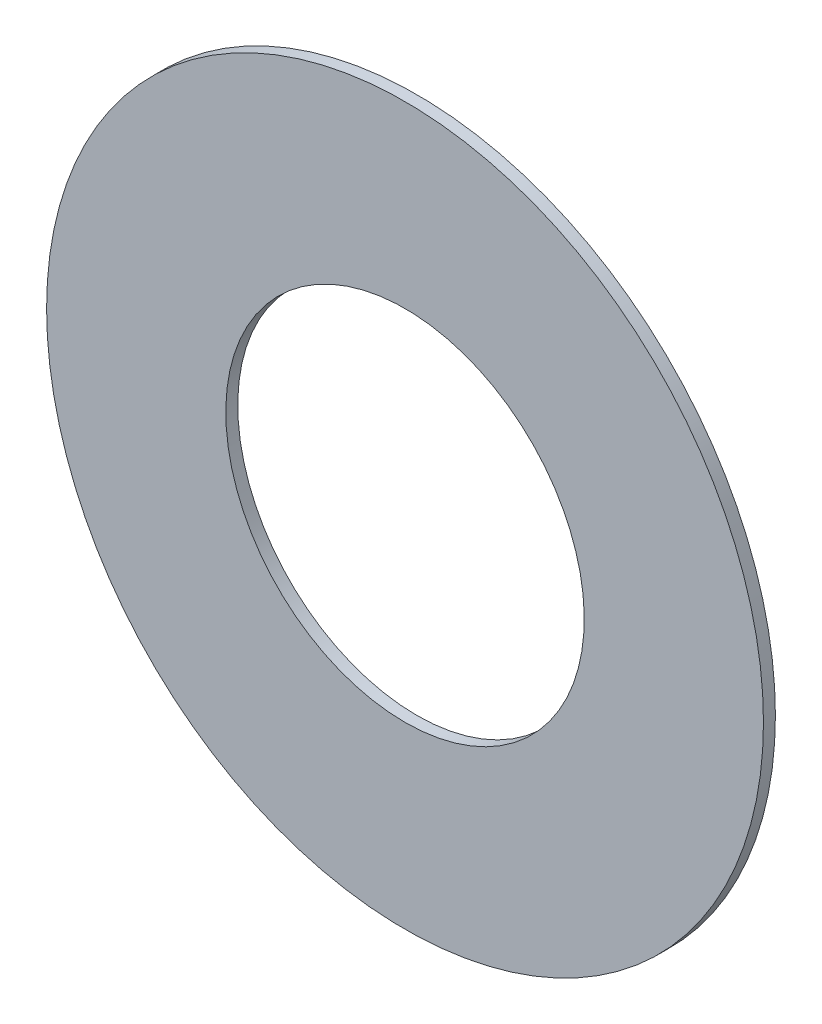
ISO-10303-21;
HEADER;
FILE_DESCRIPTION(('STEP AP214'),'2;1');
FILE_NAME('part.step','',(''),(''),'','','');
FILE_SCHEMA(('AUTOMOTIVE_DESIGN { 1 0 10303 214 1 1 1 1 }'));
ENDSEC;
DATA;
#1=APPLICATION_CONTEXT('core data for automotive mechanical design processes');
#2=APPLICATION_PROTOCOL_DEFINITION('international standard','automotive_design',2000,#1);
#3=PRODUCT_CONTEXT('',#1,'mechanical');
#4=PRODUCT('Part','Part','',(#3));
#5=PRODUCT_RELATED_PRODUCT_CATEGORY('part','',(#4));
#6=PRODUCT_DEFINITION_FORMATION('','',#4);
#7=PRODUCT_DEFINITION_CONTEXT('part definition',#1,'design');
#8=PRODUCT_DEFINITION('design','',#6,#7);
#9=PRODUCT_DEFINITION_SHAPE('','',#8);
#10=(LENGTH_UNIT() NAMED_UNIT(*) SI_UNIT(.MILLI.,.METRE.));
#11=(NAMED_UNIT(*) PLANE_ANGLE_UNIT() SI_UNIT($,.RADIAN.));
#12=(NAMED_UNIT(*) SI_UNIT($,.STERADIAN.) SOLID_ANGLE_UNIT());
#13=UNCERTAINTY_MEASURE_WITH_UNIT(LENGTH_MEASURE(1.E-05),#10,'distance_accuracy_value','');
#14=(GEOMETRIC_REPRESENTATION_CONTEXT(3) GLOBAL_UNCERTAINTY_ASSIGNED_CONTEXT((#13)) GLOBAL_UNIT_ASSIGNED_CONTEXT((#10,
#11,#12)) REPRESENTATION_CONTEXT('',''));
#15=CARTESIAN_POINT('',(0.,0.,0.));
#16=DIRECTION('',(0.,0.,1.));
#17=DIRECTION('',(1.,0.,0.));
#18=AXIS2_PLACEMENT_3D('',#15,#16,#17);
#19=CARTESIAN_POINT('',(131.852,-111.734,-0.045));
#20=DIRECTION('',(0.,0.,-1.));
#21=DIRECTION('',(0.,-1.,0.));
#22=AXIS2_PLACEMENT_3D('',#19,#20,#21);
#23=CYLINDRICAL_SURFACE('',#22,0.525);
#24=CARTESIAN_POINT('',(131.852,-111.734,1.67));
#25=DIRECTION('',(0.,0.,-1.));
#26=DIRECTION('',(0.,-1.,0.));
#27=AXIS2_PLACEMENT_3D('',#24,#25,#26);
#28=CIRCLE('',#27,0.525);
#29=CARTESIAN_POINT('',(131.852,-112.259,1.67));
#30=VERTEX_POINT('',#29);
#31=EDGE_CURVE('E25',#30,#30,#28,.T.);
#32=ORIENTED_EDGE('',*,*,#31,.T.);
#33=DIRECTION('',(0.,0.,1.));
#34=VECTOR('',#33,1.);
#35=CARTESIAN_POINT('',(131.852,-112.259,-0.045));
#36=LINE('',#35,#34);
#37=CARTESIAN_POINT('',(131.852,-112.259,1.705));
#38=VERTEX_POINT('',#37);
#39=EDGE_CURVE('E11',#30,#38,#36,.T.);
#40=ORIENTED_EDGE('',*,*,#39,.T.);
#41=CARTESIAN_POINT('',(131.852,-111.734,1.705));
#42=DIRECTION('',(0.,0.,-1.));
#43=DIRECTION('',(0.,-1.,0.));
#44=AXIS2_PLACEMENT_3D('',#41,#42,#43);
#45=CIRCLE('',#44,0.525);
#46=EDGE_CURVE('E69',#38,#38,#45,.T.);
#47=ORIENTED_EDGE('',*,*,#46,.F.);
#48=ORIENTED_EDGE('',*,*,#39,.F.);
#49=EDGE_LOOP('',(#32,#40,#47,#48));
#50=FACE_BOUND('',#49,.T.);
#51=ADVANCED_FACE('F17',(#50),#23,.F.);
#52=CARTESIAN_POINT('',(131.852,-111.734,1.67));
#53=DIRECTION('',(0.,0.,1.));
#54=DIRECTION('',(1.,0.,0.));
#55=AXIS2_PLACEMENT_3D('',#52,#53,#54);
#56=PLANE('',#55);
#57=ORIENTED_EDGE('',*,*,#31,.F.);
#58=EDGE_LOOP('',(#57));
#59=FACE_BOUND('',#58,.T.);
#60=CARTESIAN_POINT('',(131.852,-111.734,1.67));
#61=DIRECTION('',(0.,0.,1.));
#62=DIRECTION('',(1.,0.,0.));
#63=AXIS2_PLACEMENT_3D('',#60,#61,#62);
#64=CIRCLE('',#63,1.05);
#65=CARTESIAN_POINT('',(132.902,-111.734,1.67));
#66=VERTEX_POINT('',#65);
#67=EDGE_CURVE('E56',#66,#66,#64,.T.);
#68=ORIENTED_EDGE('',*,*,#67,.F.);
#69=EDGE_LOOP('',(#68));
#70=FACE_BOUND('',#69,.T.);
#71=ADVANCED_FACE('F76',(#59,#70),#56,.F.);
#72=CARTESIAN_POINT('',(131.852,-111.734,1.705));
#73=DIRECTION('',(0.,0.,1.));
#74=DIRECTION('',(1.,0.,0.));
#75=AXIS2_PLACEMENT_3D('',#72,#73,#74);
#76=PLANE('',#75);
#77=ORIENTED_EDGE('',*,*,#46,.T.);
#78=EDGE_LOOP('',(#77));
#79=FACE_BOUND('',#78,.T.);
#80=CARTESIAN_POINT('',(131.852,-111.734,1.705));
#81=DIRECTION('',(0.,0.,1.));
#82=DIRECTION('',(1.,0.,0.));
#83=AXIS2_PLACEMENT_3D('',#80,#81,#82);
#84=CIRCLE('',#83,1.05);
#85=CARTESIAN_POINT('',(132.902,-111.734,1.705));
#86=VERTEX_POINT('',#85);
#87=EDGE_CURVE('E54',#86,#86,#84,.T.);
#88=ORIENTED_EDGE('',*,*,#87,.T.);
#89=EDGE_LOOP('',(#88));
#90=FACE_BOUND('',#89,.T.);
#91=ADVANCED_FACE('F60',(#79,#90),#76,.T.);
#92=CARTESIAN_POINT('',(131.852,-111.734,1.67));
#93=DIRECTION('',(0.,0.,1.));
#94=DIRECTION('',(1.,0.,0.));
#95=AXIS2_PLACEMENT_3D('',#92,#93,#94);
#96=CYLINDRICAL_SURFACE('',#95,1.05);
#97=ORIENTED_EDGE('',*,*,#87,.F.);
#98=DIRECTION('',(0.,0.,1.));
#99=VECTOR('',#98,1.);
#100=CARTESIAN_POINT('',(132.902,-111.734,1.67));
#101=LINE('',#100,#99);
#102=EDGE_CURVE('E51',#66,#86,#101,.T.);
#103=ORIENTED_EDGE('',*,*,#102,.F.);
#104=ORIENTED_EDGE('',*,*,#67,.T.);
#105=ORIENTED_EDGE('',*,*,#102,.T.);
#106=EDGE_LOOP('',(#97,#103,#104,#105));
#107=FACE_BOUND('',#106,.T.);
#108=ADVANCED_FACE('F53',(#107),#96,.T.);
#109=CLOSED_SHELL('',(#51,#71,#91,#108));
#110=MANIFOLD_SOLID_BREP('B1',#109);
#111=ADVANCED_BREP_SHAPE_REPRESENTATION('',(#18,#110),#14);
#112=SHAPE_DEFINITION_REPRESENTATION(#9,#111);
ENDSEC;
END-ISO-10303-21;
